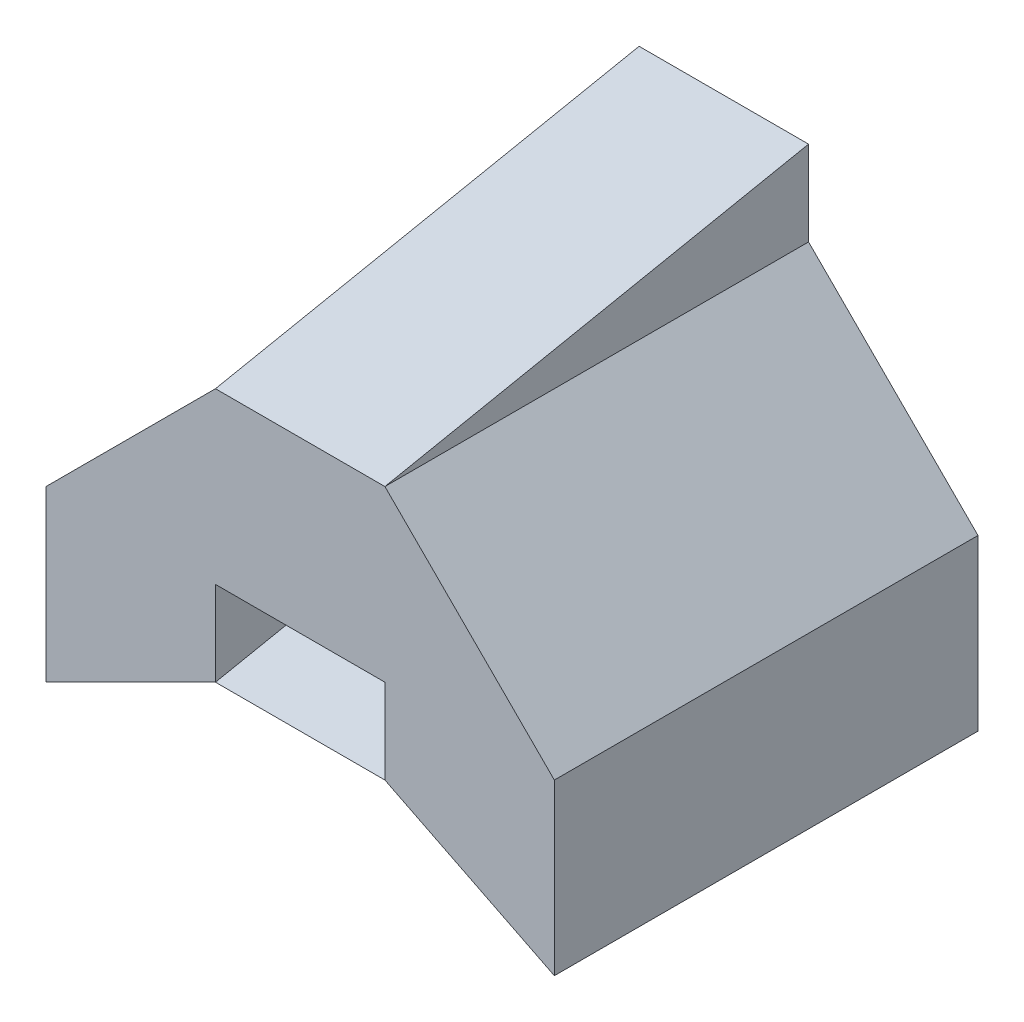
ISO-10303-21;
HEADER;
FILE_DESCRIPTION(('STEP AP214'),'2;1');
FILE_NAME('part.step','',(''),(''),'','','');
FILE_SCHEMA(('AUTOMOTIVE_DESIGN { 1 0 10303 214 1 1 1 1 }'));
ENDSEC;
DATA;
#1=APPLICATION_CONTEXT('core data for automotive mechanical design processes');
#2=APPLICATION_PROTOCOL_DEFINITION('international standard','automotive_design',2000,#1);
#3=PRODUCT_CONTEXT('',#1,'mechanical');
#4=PRODUCT('Part','Part','',(#3));
#5=PRODUCT_RELATED_PRODUCT_CATEGORY('part','',(#4));
#6=PRODUCT_DEFINITION_FORMATION('','',#4);
#7=PRODUCT_DEFINITION_CONTEXT('part definition',#1,'design');
#8=PRODUCT_DEFINITION('design','',#6,#7);
#9=PRODUCT_DEFINITION_SHAPE('','',#8);
#10=(LENGTH_UNIT() NAMED_UNIT(*) SI_UNIT(.MILLI.,.METRE.));
#11=(NAMED_UNIT(*) PLANE_ANGLE_UNIT() SI_UNIT($,.RADIAN.));
#12=(NAMED_UNIT(*) SI_UNIT($,.STERADIAN.) SOLID_ANGLE_UNIT());
#13=UNCERTAINTY_MEASURE_WITH_UNIT(LENGTH_MEASURE(1.E-05),#10,'distance_accuracy_value','');
#14=(GEOMETRIC_REPRESENTATION_CONTEXT(3) GLOBAL_UNCERTAINTY_ASSIGNED_CONTEXT((#13)) GLOBAL_UNIT_ASSIGNED_CONTEXT((#10,
#11,#12)) REPRESENTATION_CONTEXT('',''));
#15=CARTESIAN_POINT('',(0.,0.,0.));
#16=DIRECTION('',(0.,0.,1.));
#17=DIRECTION('',(1.,0.,0.));
#18=AXIS2_PLACEMENT_3D('',#15,#16,#17);
#19=CARTESIAN_POINT('',(0.,0.,0.));
#20=DIRECTION('',(0.,1.,0.));
#21=DIRECTION('',(0.,0.,1.));
#22=AXIS2_PLACEMENT_3D('',#19,#20,#21);
#23=PLANE('',#22);
#24=DIRECTION('',(0.,0.,-1.));
#25=VECTOR('',#24,1.);
#26=CARTESIAN_POINT('',(-10.,0.,0.));
#27=LINE('',#26,#25);
#28=CARTESIAN_POINT('',(-10.,0.,25.));
#29=VERTEX_POINT('',#28);
#30=CARTESIAN_POINT('',(-10.,0.,0.));
#31=VERTEX_POINT('',#30);
#32=EDGE_CURVE('E90',#29,#31,#27,.T.);
#33=ORIENTED_EDGE('',*,*,#32,.T.);
#34=DIRECTION('',(-1.,0.,0.));
#35=VECTOR('',#34,1.);
#36=CARTESIAN_POINT('',(0.,0.,0.));
#37=LINE('',#36,#35);
#38=CARTESIAN_POINT('',(0.,0.,0.));
#39=VERTEX_POINT('',#38);
#40=EDGE_CURVE('E12',#39,#31,#37,.T.);
#41=ORIENTED_EDGE('',*,*,#40,.F.);
#42=DIRECTION('',(0.,0.,-1.));
#43=VECTOR('',#42,1.);
#44=CARTESIAN_POINT('',(0.,0.,0.));
#45=LINE('',#44,#43);
#46=CARTESIAN_POINT('',(0.,0.,25.));
#47=VERTEX_POINT('',#46);
#48=EDGE_CURVE('E83',#47,#39,#45,.T.);
#49=ORIENTED_EDGE('',*,*,#48,.F.);
#50=DIRECTION('',(-1.,0.,0.));
#51=VECTOR('',#50,1.);
#52=CARTESIAN_POINT('',(0.,0.,25.));
#53=LINE('',#52,#51);
#54=EDGE_CURVE('E91',#47,#29,#53,.T.);
#55=ORIENTED_EDGE('',*,*,#54,.T.);
#56=EDGE_LOOP('',(#33,#41,#49,#55));
#57=FACE_BOUND('',#56,.T.);
#58=ADVANCED_FACE('F43',(#57),#23,.F.);
#59=CARTESIAN_POINT('',(0.,5.,0.));
#60=DIRECTION('',(0.,0.,1.));
#61=DIRECTION('',(1.,0.,0.));
#62=AXIS2_PLACEMENT_3D('',#59,#60,#61);
#63=PLANE('',#62);
#64=DIRECTION('',(0.,1.,0.));
#65=VECTOR('',#64,1.);
#66=CARTESIAN_POINT('',(-10.,5.,0.));
#67=LINE('',#66,#65);
#68=CARTESIAN_POINT('',(-10.,5.,0.));
#69=VERTEX_POINT('',#68);
#70=EDGE_CURVE('E71',#31,#69,#67,.T.);
#71=ORIENTED_EDGE('',*,*,#70,.T.);
#72=DIRECTION('',(-1.,0.,0.));
#73=VECTOR('',#72,1.);
#74=CARTESIAN_POINT('',(0.,5.,0.));
#75=LINE('',#74,#73);
#76=CARTESIAN_POINT('',(0.,5.,0.));
#77=VERTEX_POINT('',#76);
#78=EDGE_CURVE('E51',#77,#69,#75,.T.);
#79=ORIENTED_EDGE('',*,*,#78,.F.);
#80=DIRECTION('',(0.,1.,0.));
#81=VECTOR('',#80,1.);
#82=CARTESIAN_POINT('',(0.,5.,0.));
#83=LINE('',#82,#81);
#84=EDGE_CURVE('E79',#39,#77,#83,.T.);
#85=ORIENTED_EDGE('',*,*,#84,.F.);
#86=ORIENTED_EDGE('',*,*,#40,.T.);
#87=EDGE_LOOP('',(#71,#79,#85,#86));
#88=FACE_BOUND('',#87,.T.);
#89=ADVANCED_FACE('F80',(#88),#63,.F.);
#90=CARTESIAN_POINT('',(0.,0.,25.));
#91=DIRECTION('',(0.,-0.98058067569092,-0.196116135138184));
#92=DIRECTION('',(0.,0.196116135138184,-0.98058067569092));
#93=AXIS2_PLACEMENT_3D('',#90,#91,#92);
#94=PLANE('',#93);
#95=DIRECTION('',(0.,-0.196116135138184,0.98058067569092));
#96=VECTOR('',#95,1.);
#97=CARTESIAN_POINT('',(-10.,0.,25.));
#98=LINE('',#97,#96);
#99=EDGE_CURVE('E76',#69,#29,#98,.T.);
#100=ORIENTED_EDGE('',*,*,#99,.T.);
#101=ORIENTED_EDGE('',*,*,#54,.F.);
#102=DIRECTION('',(0.,-0.196116135138184,0.98058067569092));
#103=VECTOR('',#102,1.);
#104=CARTESIAN_POINT('',(0.,0.,25.));
#105=LINE('',#104,#103);
#106=EDGE_CURVE('E59',#77,#47,#105,.T.);
#107=ORIENTED_EDGE('',*,*,#106,.F.);
#108=ORIENTED_EDGE('',*,*,#78,.T.);
#109=EDGE_LOOP('',(#100,#101,#107,#108));
#110=FACE_BOUND('',#109,.T.);
#111=ADVANCED_FACE('F98',(#110),#94,.F.);
#112=CARTESIAN_POINT('',(0.,0.,0.));
#113=DIRECTION('',(1.,0.,0.));
#114=DIRECTION('',(0.,0.,-1.));
#115=AXIS2_PLACEMENT_3D('',#112,#113,#114);
#116=PLANE('',#115);
#117=ORIENTED_EDGE('',*,*,#48,.T.);
#118=ORIENTED_EDGE('',*,*,#84,.T.);
#119=ORIENTED_EDGE('',*,*,#106,.T.);
#120=EDGE_LOOP('',(#117,#118,#119));
#121=FACE_BOUND('',#120,.T.);
#122=ADVANCED_FACE('F86',(#121),#116,.T.);
#123=CARTESIAN_POINT('',(-10.,0.,0.));
#124=DIRECTION('',(1.,0.,0.));
#125=DIRECTION('',(0.,0.,-1.));
#126=AXIS2_PLACEMENT_3D('',#123,#124,#125);
#127=PLANE('',#126);
#128=ORIENTED_EDGE('',*,*,#32,.F.);
#129=ORIENTED_EDGE('',*,*,#99,.F.);
#130=ORIENTED_EDGE('',*,*,#70,.F.);
#131=EDGE_LOOP('',(#128,#129,#130));
#132=FACE_BOUND('',#131,.T.);
#133=ADVANCED_FACE('F99',(#132),#127,.F.);
#134=CLOSED_SHELL('',(#58,#89,#111,#122,#133));
#135=MANIFOLD_SOLID_BREP('B2',#134);
#136=CARTESIAN_POINT('',(-20.,5.,25.));
#137=DIRECTION('',(0.707106781186548,-0.707106781186547,0.));
#138=DIRECTION('',(0.707106781186547,0.707106781186548,0.));
#139=AXIS2_PLACEMENT_3D('',#136,#137,#138);
#140=PLANE('',#139);
#141=DIRECTION('',(-0.707106781186547,-0.707106781186548,0.));
#142=VECTOR('',#141,1.);
#143=CARTESIAN_POINT('',(-20.,5.,0.));
#144=LINE('',#143,#142);
#145=CARTESIAN_POINT('',(-10.,15.,0.));
#146=VERTEX_POINT('',#145);
#147=CARTESIAN_POINT('',(-20.,5.,0.));
#148=VERTEX_POINT('',#147);
#149=EDGE_CURVE('E259',#146,#148,#144,.T.);
#150=ORIENTED_EDGE('',*,*,#149,.T.);
#151=DIRECTION('',(0.,0.,-1.));
#152=VECTOR('',#151,1.);
#153=CARTESIAN_POINT('',(-20.,5.,25.));
#154=LINE('',#153,#152);
#155=CARTESIAN_POINT('',(-20.,5.,25.));
#156=VERTEX_POINT('',#155);
#157=EDGE_CURVE('E41',#156,#148,#154,.T.);
#158=ORIENTED_EDGE('',*,*,#157,.F.);
#159=DIRECTION('',(-0.707106781186547,-0.707106781186548,0.));
#160=VECTOR('',#159,1.);
#161=CARTESIAN_POINT('',(-20.,5.,25.));
#162=LINE('',#161,#160);
#163=CARTESIAN_POINT('',(-9.99999999999999,15.,25.));
#164=VERTEX_POINT('',#163);
#165=EDGE_CURVE('E283',#164,#156,#162,.T.);
#166=ORIENTED_EDGE('',*,*,#165,.F.);
#167=DIRECTION('',(0.,0.,-1.));
#168=VECTOR('',#167,1.);
#169=CARTESIAN_POINT('',(-10.,15.,25.));
#170=LINE('',#169,#168);
#171=EDGE_CURVE('E258',#164,#146,#170,.T.);
#172=ORIENTED_EDGE('',*,*,#171,.T.);
#173=EDGE_LOOP('',(#150,#158,#166,#172));
#174=FACE_BOUND('',#173,.T.);
#175=ADVANCED_FACE('F141',(#174),#140,.F.);
#176=CARTESIAN_POINT('',(-20.,-5.,25.));
#177=DIRECTION('',(1.,0.,0.));
#178=DIRECTION('',(0.,0.,-1.));
#179=AXIS2_PLACEMENT_3D('',#176,#177,#178);
#180=PLANE('',#179);
#181=DIRECTION('',(0.,-1.,0.));
#182=VECTOR('',#181,1.);
#183=CARTESIAN_POINT('',(-20.,-5.,0.));
#184=LINE('',#183,#182);
#185=CARTESIAN_POINT('',(-20.,-5.,0.));
#186=VERTEX_POINT('',#185);
#187=EDGE_CURVE('E262',#148,#186,#184,.T.);
#188=ORIENTED_EDGE('',*,*,#187,.T.);
#189=DIRECTION('',(0.,0.,-1.));
#190=VECTOR('',#189,1.);
#191=CARTESIAN_POINT('',(-20.,-5.,25.));
#192=LINE('',#191,#190);
#193=CARTESIAN_POINT('',(-20.,-5.,25.));
#194=VERTEX_POINT('',#193);
#195=EDGE_CURVE('E149',#194,#186,#192,.T.);
#196=ORIENTED_EDGE('',*,*,#195,.F.);
#197=DIRECTION('',(0.,-1.,0.));
#198=VECTOR('',#197,1.);
#199=CARTESIAN_POINT('',(-20.,-5.,25.));
#200=LINE('',#199,#198);
#201=EDGE_CURVE('E212',#156,#194,#200,.T.);
#202=ORIENTED_EDGE('',*,*,#201,.F.);
#203=ORIENTED_EDGE('',*,*,#157,.T.);
#204=EDGE_LOOP('',(#188,#196,#202,#203));
#205=FACE_BOUND('',#204,.T.);
#206=ADVANCED_FACE('F345',(#205),#180,.F.);
#207=CARTESIAN_POINT('',(-10.,0.,25.));
#208=DIRECTION('',(-0.447213595499958,0.894427190999916,0.));
#209=DIRECTION('',(-0.894427190999916,-0.447213595499958,0.));
#210=AXIS2_PLACEMENT_3D('',#207,#208,#209);
#211=PLANE('',#210);
#212=DIRECTION('',(0.894427190999916,0.447213595499958,0.));
#213=VECTOR('',#212,1.);
#214=CARTESIAN_POINT('',(-10.,0.,0.));
#215=LINE('',#214,#213);
#216=CARTESIAN_POINT('',(-10.,0.,0.));
#217=VERTEX_POINT('',#216);
#218=EDGE_CURVE('E265',#186,#217,#215,.T.);
#219=ORIENTED_EDGE('',*,*,#218,.T.);
#220=DIRECTION('',(0.,0.,-1.));
#221=VECTOR('',#220,1.);
#222=CARTESIAN_POINT('',(-10.,0.,25.));
#223=LINE('',#222,#221);
#224=CARTESIAN_POINT('',(-10.,0.,25.));
#225=VERTEX_POINT('',#224);
#226=EDGE_CURVE('E296',#225,#217,#223,.T.);
#227=ORIENTED_EDGE('',*,*,#226,.F.);
#228=DIRECTION('',(0.894427190999916,0.447213595499958,0.));
#229=VECTOR('',#228,1.);
#230=CARTESIAN_POINT('',(-10.,0.,25.));
#231=LINE('',#230,#229);
#232=EDGE_CURVE('E304',#194,#225,#231,.T.);
#233=ORIENTED_EDGE('',*,*,#232,.F.);
#234=ORIENTED_EDGE('',*,*,#195,.T.);
#235=EDGE_LOOP('',(#219,#227,#233,#234));
#236=FACE_BOUND('',#235,.T.);
#237=ADVANCED_FACE('F302',(#236),#211,.F.);
#238=CARTESIAN_POINT('',(-10.,5.,25.));
#239=DIRECTION('',(-1.,0.,0.));
#240=DIRECTION('',(0.,0.,1.));
#241=AXIS2_PLACEMENT_3D('',#238,#239,#240);
#242=PLANE('',#241);
#243=DIRECTION('',(0.,1.,0.));
#244=VECTOR('',#243,1.);
#245=CARTESIAN_POINT('',(-10.,5.,0.));
#246=LINE('',#245,#244);
#247=CARTESIAN_POINT('',(-10.,5.,0.));
#248=VERTEX_POINT('',#247);
#249=EDGE_CURVE('E267',#217,#248,#246,.T.);
#250=ORIENTED_EDGE('',*,*,#249,.T.);
#251=DIRECTION('',(0.,0.,-1.));
#252=VECTOR('',#251,1.);
#253=CARTESIAN_POINT('',(-10.,5.,25.));
#254=LINE('',#253,#252);
#255=CARTESIAN_POINT('',(-10.,5.,25.));
#256=VERTEX_POINT('',#255);
#257=EDGE_CURVE('E293',#256,#248,#254,.T.);
#258=ORIENTED_EDGE('',*,*,#257,.F.);
#259=DIRECTION('',(0.,1.,0.));
#260=VECTOR('',#259,1.);
#261=CARTESIAN_POINT('',(-10.,5.,25.));
#262=LINE('',#261,#260);
#263=EDGE_CURVE('E316',#225,#256,#262,.T.);
#264=ORIENTED_EDGE('',*,*,#263,.F.);
#265=ORIENTED_EDGE('',*,*,#226,.T.);
#266=EDGE_LOOP('',(#250,#258,#264,#265));
#267=FACE_BOUND('',#266,.T.);
#268=ADVANCED_FACE('F312',(#267),#242,.F.);
#269=CARTESIAN_POINT('',(0.,5.,25.));
#270=DIRECTION('',(0.,1.,0.));
#271=DIRECTION('',(-1.,0.,0.));
#272=AXIS2_PLACEMENT_3D('',#269,#270,#271);
#273=PLANE('',#272);
#274=DIRECTION('',(1.,0.,0.));
#275=VECTOR('',#274,1.);
#276=CARTESIAN_POINT('',(0.,5.,0.));
#277=LINE('',#276,#275);
#278=CARTESIAN_POINT('',(0.,5.,0.));
#279=VERTEX_POINT('',#278);
#280=EDGE_CURVE('E269',#248,#279,#277,.T.);
#281=ORIENTED_EDGE('',*,*,#280,.T.);
#282=DIRECTION('',(0.,0.,-1.));
#283=VECTOR('',#282,1.);
#284=CARTESIAN_POINT('',(0.,5.,25.));
#285=LINE('',#284,#283);
#286=CARTESIAN_POINT('',(0.,5.,25.));
#287=VERTEX_POINT('',#286);
#288=EDGE_CURVE('E247',#287,#279,#285,.T.);
#289=ORIENTED_EDGE('',*,*,#288,.F.);
#290=DIRECTION('',(1.,0.,0.));
#291=VECTOR('',#290,1.);
#292=CARTESIAN_POINT('',(0.,5.,25.));
#293=LINE('',#292,#291);
#294=EDGE_CURVE('E235',#256,#287,#293,.T.);
#295=ORIENTED_EDGE('',*,*,#294,.F.);
#296=ORIENTED_EDGE('',*,*,#257,.T.);
#297=EDGE_LOOP('',(#281,#289,#295,#296));
#298=FACE_BOUND('',#297,.T.);
#299=ADVANCED_FACE('F315',(#298),#273,.F.);
#300=CARTESIAN_POINT('',(0.,0.,25.));
#301=DIRECTION('',(1.,0.,0.));
#302=DIRECTION('',(0.,0.,-1.));
#303=AXIS2_PLACEMENT_3D('',#300,#301,#302);
#304=PLANE('',#303);
#305=DIRECTION('',(0.,-1.,0.));
#306=VECTOR('',#305,1.);
#307=CARTESIAN_POINT('',(0.,0.,0.));
#308=LINE('',#307,#306);
#309=CARTESIAN_POINT('',(0.,0.,0.));
#310=VERTEX_POINT('',#309);
#311=EDGE_CURVE('E244',#279,#310,#308,.T.);
#312=ORIENTED_EDGE('',*,*,#311,.T.);
#313=DIRECTION('',(0.,0.,-1.));
#314=VECTOR('',#313,1.);
#315=CARTESIAN_POINT('',(0.,0.,25.));
#316=LINE('',#315,#314);
#317=CARTESIAN_POINT('',(0.,0.,25.));
#318=VERTEX_POINT('',#317);
#319=EDGE_CURVE('E241',#318,#310,#316,.T.);
#320=ORIENTED_EDGE('',*,*,#319,.F.);
#321=DIRECTION('',(0.,-1.,0.));
#322=VECTOR('',#321,1.);
#323=CARTESIAN_POINT('',(0.,0.,25.));
#324=LINE('',#323,#322);
#325=EDGE_CURVE('E228',#287,#318,#324,.T.);
#326=ORIENTED_EDGE('',*,*,#325,.F.);
#327=ORIENTED_EDGE('',*,*,#288,.T.);
#328=EDGE_LOOP('',(#312,#320,#326,#327));
#329=FACE_BOUND('',#328,.T.);
#330=ADVANCED_FACE('F242',(#329),#304,.F.);
#331=CARTESIAN_POINT('',(10.,-5.,25.));
#332=DIRECTION('',(0.447213595499958,0.894427190999916,0.));
#333=DIRECTION('',(-0.894427190999916,0.447213595499958,0.));
#334=AXIS2_PLACEMENT_3D('',#331,#332,#333);
#335=PLANE('',#334);
#336=DIRECTION('',(0.894427190999916,-0.447213595499958,0.));
#337=VECTOR('',#336,1.);
#338=CARTESIAN_POINT('',(10.,-5.,0.));
#339=LINE('',#338,#337);
#340=CARTESIAN_POINT('',(10.,-5.,0.));
#341=VERTEX_POINT('',#340);
#342=EDGE_CURVE('E272',#310,#341,#339,.T.);
#343=ORIENTED_EDGE('',*,*,#342,.T.);
#344=DIRECTION('',(0.,0.,-1.));
#345=VECTOR('',#344,1.);
#346=CARTESIAN_POINT('',(10.,-5.,25.));
#347=LINE('',#346,#345);
#348=CARTESIAN_POINT('',(10.,-5.,25.));
#349=VERTEX_POINT('',#348);
#350=EDGE_CURVE('E248',#349,#341,#347,.T.);
#351=ORIENTED_EDGE('',*,*,#350,.F.);
#352=DIRECTION('',(0.894427190999916,-0.447213595499958,0.));
#353=VECTOR('',#352,1.);
#354=CARTESIAN_POINT('',(10.,-5.,25.));
#355=LINE('',#354,#353);
#356=EDGE_CURVE('E232',#318,#349,#355,.T.);
#357=ORIENTED_EDGE('',*,*,#356,.F.);
#358=ORIENTED_EDGE('',*,*,#319,.T.);
#359=EDGE_LOOP('',(#343,#351,#357,#358));
#360=FACE_BOUND('',#359,.T.);
#361=ADVANCED_FACE('F250',(#360),#335,.F.);
#362=CARTESIAN_POINT('',(10.,5.,25.));
#363=DIRECTION('',(-1.,0.,0.));
#364=DIRECTION('',(0.,0.,1.));
#365=AXIS2_PLACEMENT_3D('',#362,#363,#364);
#366=PLANE('',#365);
#367=DIRECTION('',(0.,1.,0.));
#368=VECTOR('',#367,1.);
#369=CARTESIAN_POINT('',(10.,5.,0.));
#370=LINE('',#369,#368);
#371=CARTESIAN_POINT('',(10.,5.,0.));
#372=VERTEX_POINT('',#371);
#373=EDGE_CURVE('E274',#341,#372,#370,.T.);
#374=ORIENTED_EDGE('',*,*,#373,.T.);
#375=DIRECTION('',(0.,0.,-1.));
#376=VECTOR('',#375,1.);
#377=CARTESIAN_POINT('',(10.,5.,25.));
#378=LINE('',#377,#376);
#379=CARTESIAN_POINT('',(10.,5.,25.));
#380=VERTEX_POINT('',#379);
#381=EDGE_CURVE('E288',#380,#372,#378,.T.);
#382=ORIENTED_EDGE('',*,*,#381,.F.);
#383=DIRECTION('',(0.,1.,0.));
#384=VECTOR('',#383,1.);
#385=CARTESIAN_POINT('',(10.,5.,25.));
#386=LINE('',#385,#384);
#387=EDGE_CURVE('E157',#349,#380,#386,.T.);
#388=ORIENTED_EDGE('',*,*,#387,.F.);
#389=ORIENTED_EDGE('',*,*,#350,.T.);
#390=EDGE_LOOP('',(#374,#382,#388,#389));
#391=FACE_BOUND('',#390,.T.);
#392=ADVANCED_FACE('F361',(#391),#366,.F.);
#393=CARTESIAN_POINT('',(0.,15.,25.));
#394=DIRECTION('',(-0.707106781186547,-0.707106781186548,0.));
#395=DIRECTION('',(0.707106781186548,-0.707106781186547,0.));
#396=AXIS2_PLACEMENT_3D('',#393,#394,#395);
#397=PLANE('',#396);
#398=DIRECTION('',(-0.707106781186548,0.707106781186547,0.));
#399=VECTOR('',#398,1.);
#400=CARTESIAN_POINT('',(0.,15.,0.));
#401=LINE('',#400,#399);
#402=CARTESIAN_POINT('',(0.,15.,0.));
#403=VERTEX_POINT('',#402);
#404=EDGE_CURVE('E276',#372,#403,#401,.T.);
#405=ORIENTED_EDGE('',*,*,#404,.T.);
#406=DIRECTION('',(0.,0.,-1.));
#407=VECTOR('',#406,1.);
#408=CARTESIAN_POINT('',(0.,15.,25.));
#409=LINE('',#408,#407);
#410=CARTESIAN_POINT('',(0.,15.,25.));
#411=VERTEX_POINT('',#410);
#412=EDGE_CURVE('E285',#411,#403,#409,.T.);
#413=ORIENTED_EDGE('',*,*,#412,.F.);
#414=DIRECTION('',(-0.707106781186548,0.707106781186547,0.));
#415=VECTOR('',#414,1.);
#416=CARTESIAN_POINT('',(0.,15.,25.));
#417=LINE('',#416,#415);
#418=EDGE_CURVE('E253',#380,#411,#417,.T.);
#419=ORIENTED_EDGE('',*,*,#418,.F.);
#420=ORIENTED_EDGE('',*,*,#381,.T.);
#421=EDGE_LOOP('',(#405,#413,#419,#420));
#422=FACE_BOUND('',#421,.T.);
#423=ADVANCED_FACE('F338',(#422),#397,.F.);
#424=CARTESIAN_POINT('',(0.,20.,25.));
#425=DIRECTION('',(-1.,0.,0.));
#426=DIRECTION('',(0.,0.,1.));
#427=AXIS2_PLACEMENT_3D('',#424,#425,#426);
#428=PLANE('',#427);
#429=DIRECTION('',(0.,1.,0.));
#430=VECTOR('',#429,1.);
#431=CARTESIAN_POINT('',(0.,20.,0.));
#432=LINE('',#431,#430);
#433=CARTESIAN_POINT('',(0.,20.,0.));
#434=VERTEX_POINT('',#433);
#435=EDGE_CURVE('E278',#403,#434,#432,.T.);
#436=ORIENTED_EDGE('',*,*,#435,.T.);
#437=DIRECTION('',(0.,0.196116135138184,-0.98058067569092));
#438=VECTOR('',#437,1.);
#439=CARTESIAN_POINT('',(0.,15.,25.));
#440=LINE('',#439,#438);
#441=EDGE_CURVE('E196',#411,#434,#440,.T.);
#442=ORIENTED_EDGE('',*,*,#441,.F.);
#443=ORIENTED_EDGE('',*,*,#412,.T.);
#444=EDGE_LOOP('',(#436,#442,#443));
#445=FACE_BOUND('',#444,.T.);
#446=ADVANCED_FACE('F332',(#445),#428,.F.);
#447=CARTESIAN_POINT('',(-10.,15.,25.));
#448=DIRECTION('',(1.,0.,0.));
#449=DIRECTION('',(0.,0.,-1.));
#450=AXIS2_PLACEMENT_3D('',#447,#448,#449);
#451=PLANE('',#450);
#452=ORIENTED_EDGE('',*,*,#171,.F.);
#453=DIRECTION('',(0.,0.196116135138184,-0.98058067569092));
#454=VECTOR('',#453,1.);
#455=CARTESIAN_POINT('',(-10.,15.,25.));
#456=LINE('',#455,#454);
#457=CARTESIAN_POINT('',(-9.99999999999999,20.,0.));
#458=VERTEX_POINT('',#457);
#459=EDGE_CURVE('E263',#164,#458,#456,.T.);
#460=ORIENTED_EDGE('',*,*,#459,.T.);
#461=DIRECTION('',(0.,-1.,0.));
#462=VECTOR('',#461,1.);
#463=CARTESIAN_POINT('',(-10.,15.,0.));
#464=LINE('',#463,#462);
#465=EDGE_CURVE('E204',#458,#146,#464,.T.);
#466=ORIENTED_EDGE('',*,*,#465,.T.);
#467=EDGE_LOOP('',(#452,#460,#466));
#468=FACE_BOUND('',#467,.T.);
#469=ADVANCED_FACE('F341',(#468),#451,.F.);
#470=CARTESIAN_POINT('',(0.,0.,25.));
#471=DIRECTION('',(0.,0.,-1.));
#472=DIRECTION('',(-1.,0.,0.));
#473=AXIS2_PLACEMENT_3D('',#470,#471,#472);
#474=PLANE('',#473);
#475=ORIENTED_EDGE('',*,*,#418,.T.);
#476=DIRECTION('',(1.,0.,0.));
#477=VECTOR('',#476,1.);
#478=CARTESIAN_POINT('',(-25.,15.,25.));
#479=LINE('',#478,#477);
#480=EDGE_CURVE('E323',#164,#411,#479,.T.);
#481=ORIENTED_EDGE('',*,*,#480,.F.);
#482=ORIENTED_EDGE('',*,*,#165,.T.);
#483=ORIENTED_EDGE('',*,*,#201,.T.);
#484=ORIENTED_EDGE('',*,*,#232,.T.);
#485=ORIENTED_EDGE('',*,*,#263,.T.);
#486=ORIENTED_EDGE('',*,*,#294,.T.);
#487=ORIENTED_EDGE('',*,*,#325,.T.);
#488=ORIENTED_EDGE('',*,*,#356,.T.);
#489=ORIENTED_EDGE('',*,*,#387,.T.);
#490=EDGE_LOOP('',(#475,#481,#482,#483,#484,#485,#486,#487,#488,#489));
#491=FACE_BOUND('',#490,.T.);
#492=ADVANCED_FACE('F230',(#491),#474,.F.);
#493=CARTESIAN_POINT('',(0.,0.,0.));
#494=DIRECTION('',(0.,0.,-1.));
#495=DIRECTION('',(-1.,0.,0.));
#496=AXIS2_PLACEMENT_3D('',#493,#494,#495);
#497=PLANE('',#496);
#498=ORIENTED_EDGE('',*,*,#149,.F.);
#499=ORIENTED_EDGE('',*,*,#465,.F.);
#500=DIRECTION('',(-1.,0.,0.));
#501=VECTOR('',#500,1.);
#502=CARTESIAN_POINT('',(-10.,20.,0.));
#503=LINE('',#502,#501);
#504=EDGE_CURVE('E280',#434,#458,#503,.T.);
#505=ORIENTED_EDGE('',*,*,#504,.F.);
#506=ORIENTED_EDGE('',*,*,#435,.F.);
#507=ORIENTED_EDGE('',*,*,#404,.F.);
#508=ORIENTED_EDGE('',*,*,#373,.F.);
#509=ORIENTED_EDGE('',*,*,#342,.F.);
#510=ORIENTED_EDGE('',*,*,#311,.F.);
#511=ORIENTED_EDGE('',*,*,#280,.F.);
#512=ORIENTED_EDGE('',*,*,#249,.F.);
#513=ORIENTED_EDGE('',*,*,#218,.F.);
#514=ORIENTED_EDGE('',*,*,#187,.F.);
#515=EDGE_LOOP('',(#498,#499,#505,#506,#507,#508,#509,#510,#511,#512,#513,#514));
#516=FACE_BOUND('',#515,.T.);
#517=ADVANCED_FACE('F308',(#516),#497,.T.);
#518=CARTESIAN_POINT('',(-25.,15.,25.));
#519=DIRECTION('',(0.,-0.98058067569092,-0.196116135138184));
#520=DIRECTION('',(0.,0.196116135138184,-0.98058067569092));
#521=AXIS2_PLACEMENT_3D('',#518,#519,#520);
#522=PLANE('',#521);
#523=ORIENTED_EDGE('',*,*,#480,.T.);
#524=ORIENTED_EDGE('',*,*,#441,.T.);
#525=ORIENTED_EDGE('',*,*,#504,.T.);
#526=ORIENTED_EDGE('',*,*,#459,.F.);
#527=EDGE_LOOP('',(#523,#524,#525,#526));
#528=FACE_BOUND('',#527,.T.);
#529=ADVANCED_FACE('F328',(#528),#522,.F.);
#530=CLOSED_SHELL('',(#175,#206,#237,#268,#299,#330,#361,#392,#423,#446,#469,#492,#517,#529));
#531=MANIFOLD_SOLID_BREP('B6',#530);
#532=ADVANCED_BREP_SHAPE_REPRESENTATION('',(#18,#135,#531),#14);
#533=SHAPE_DEFINITION_REPRESENTATION(#9,#532);
ENDSEC;
END-ISO-10303-21;
